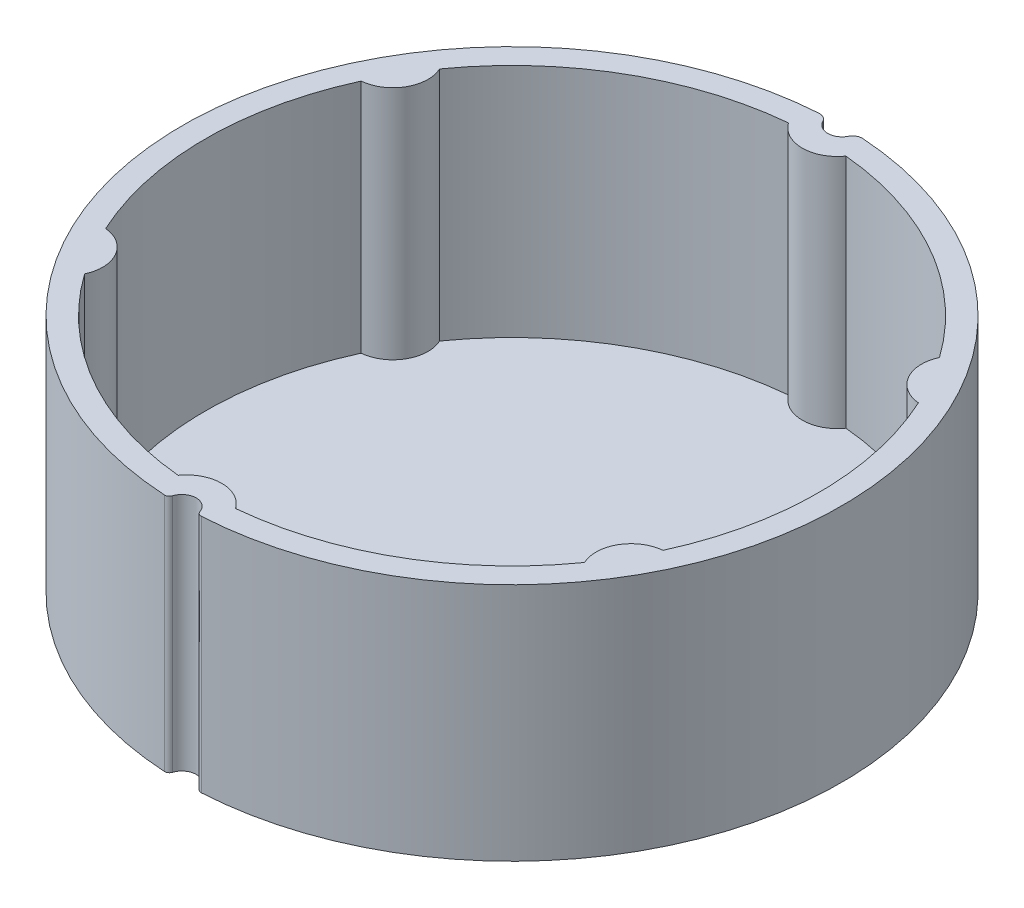
ISO-10303-21;
HEADER;
FILE_DESCRIPTION(('STEP AP214'),'2;1');
FILE_NAME('part.step','',(''),(''),'','','');
FILE_SCHEMA(('AUTOMOTIVE_DESIGN { 1 0 10303 214 1 1 1 1 }'));
ENDSEC;
DATA;
#1=APPLICATION_CONTEXT('core data for automotive mechanical design processes');
#2=APPLICATION_PROTOCOL_DEFINITION('international standard','automotive_design',2000,#1);
#3=PRODUCT_CONTEXT('',#1,'mechanical');
#4=PRODUCT('Part','Part','',(#3));
#5=PRODUCT_RELATED_PRODUCT_CATEGORY('part','',(#4));
#6=PRODUCT_DEFINITION_FORMATION('','',#4);
#7=PRODUCT_DEFINITION_CONTEXT('part definition',#1,'design');
#8=PRODUCT_DEFINITION('design','',#6,#7);
#9=PRODUCT_DEFINITION_SHAPE('','',#8);
#10=(LENGTH_UNIT() NAMED_UNIT(*) SI_UNIT(.MILLI.,.METRE.));
#11=(NAMED_UNIT(*) PLANE_ANGLE_UNIT() SI_UNIT($,.RADIAN.));
#12=(NAMED_UNIT(*) SI_UNIT($,.STERADIAN.) SOLID_ANGLE_UNIT());
#13=UNCERTAINTY_MEASURE_WITH_UNIT(LENGTH_MEASURE(1.E-05),#10,'distance_accuracy_value','');
#14=(GEOMETRIC_REPRESENTATION_CONTEXT(3) GLOBAL_UNCERTAINTY_ASSIGNED_CONTEXT((#13)) GLOBAL_UNIT_ASSIGNED_CONTEXT((#10,
#11,#12)) REPRESENTATION_CONTEXT('',''));
#15=CARTESIAN_POINT('',(0.,0.,0.));
#16=DIRECTION('',(0.,0.,1.));
#17=DIRECTION('',(1.,0.,0.));
#18=AXIS2_PLACEMENT_3D('',#15,#16,#17);
#19=CARTESIAN_POINT('',(0.,-90.5096679918781,0.));
#20=DIRECTION('',(0.,1.,0.));
#21=DIRECTION('',(0.,0.,1.));
#22=AXIS2_PLACEMENT_3D('',#19,#20,#21);
#23=CYLINDRICAL_SURFACE('',#22,32.);
#24=DIRECTION('',(0.,-1.,0.));
#25=VECTOR('',#24,1.);
#26=CARTESIAN_POINT('',(-29.0907593226426,31.177738025806,-13.331456110721));
#27=LINE('',#26,#25);
#28=CARTESIAN_POINT('',(-29.0907593226426,25.,-13.331456110721));
#29=VERTEX_POINT('',#28);
#30=CARTESIAN_POINT('',(-29.0907593226426,0.400000000000001,-13.331456110721));
#31=VERTEX_POINT('',#30);
#32=EDGE_CURVE('E58',#29,#31,#27,.T.);
#33=ORIENTED_EDGE('',*,*,#32,.F.);
#34=CARTESIAN_POINT('',(0.,25.,0.));
#35=DIRECTION('',(0.,1.,0.));
#36=DIRECTION('',(0.,0.,1.));
#37=AXIS2_PLACEMENT_3D('',#34,#35,#36);
#38=CIRCLE('',#37,32.);
#39=CARTESIAN_POINT('',(-29.0907593226429,25.,13.3314561107204));
#40=VERTEX_POINT('',#39);
#41=EDGE_CURVE('E191',#29,#40,#38,.T.);
#42=ORIENTED_EDGE('',*,*,#41,.T.);
#43=DIRECTION('',(0.,-1.,0.));
#44=VECTOR('',#43,1.);
#45=CARTESIAN_POINT('',(-29.0907593226429,31.177738025806,13.3314561107204));
#46=LINE('',#45,#44);
#47=CARTESIAN_POINT('',(-29.0907593226429,0.4,13.3314561107204));
#48=VERTEX_POINT('',#47);
#49=EDGE_CURVE('E185',#40,#48,#46,.T.);
#50=ORIENTED_EDGE('',*,*,#49,.T.);
#51=CARTESIAN_POINT('',(0.,0.399999999999998,0.));
#52=DIRECTION('',(0.,1.,0.));
#53=DIRECTION('',(0.,0.,1.));
#54=AXIS2_PLACEMENT_3D('',#51,#52,#53);
#55=CIRCLE('',#54,32.);
#56=EDGE_CURVE('E194',#48,#31,#55,.F.);
#57=ORIENTED_EDGE('',*,*,#56,.T.);
#58=EDGE_LOOP('',(#33,#42,#50,#57));
#59=FACE_BOUND('',#58,.T.);
#60=ADVANCED_FACE('F43',(#59),#23,.F.);
#61=DIRECTION('',(0.,-1.,0.));
#62=VECTOR('',#61,1.);
#63=CARTESIAN_POINT('',(-26.0907593226426,31.177738025806,-18.5276085334276));
#64=LINE('',#63,#62);
#65=CARTESIAN_POINT('',(-26.0907593226426,25.,-18.5276085334276));
#66=VERTEX_POINT('',#65);
#67=CARTESIAN_POINT('',(-26.0907593226426,0.4,-18.5276085334276));
#68=VERTEX_POINT('',#67);
#69=EDGE_CURVE('E180',#66,#68,#64,.T.);
#70=ORIENTED_EDGE('',*,*,#69,.T.);
#71=CARTESIAN_POINT('',(-2.99999999999998,0.400000000000001,-31.859064644148));
#72=VERTEX_POINT('',#71);
#73=EDGE_CURVE('E204',#68,#72,#55,.F.);
#74=ORIENTED_EDGE('',*,*,#73,.T.);
#75=DIRECTION('',(0.,-1.,0.));
#76=VECTOR('',#75,1.);
#77=CARTESIAN_POINT('',(-3.,31.2361847310675,-31.859064644148));
#78=LINE('',#77,#76);
#79=CARTESIAN_POINT('',(-3.,25.,-31.859064644148));
#80=VERTEX_POINT('',#79);
#81=EDGE_CURVE('E354',#80,#72,#78,.T.);
#82=ORIENTED_EDGE('',*,*,#81,.F.);
#83=EDGE_CURVE('E201',#80,#66,#38,.T.);
#84=ORIENTED_EDGE('',*,*,#83,.T.);
#85=EDGE_LOOP('',(#70,#74,#82,#84));
#86=FACE_BOUND('',#85,.T.);
#87=ADVANCED_FACE('F318',(#86),#23,.F.);
#88=DIRECTION('',(0.,-1.,0.));
#89=VECTOR('',#88,1.);
#90=CARTESIAN_POINT('',(-26.090759322643,31.177738025806,18.5276085334271));
#91=LINE('',#90,#89);
#92=CARTESIAN_POINT('',(-26.090759322643,25.,18.5276085334271));
#93=VERTEX_POINT('',#92);
#94=CARTESIAN_POINT('',(-26.090759322643,0.400000000000001,18.527608533427));
#95=VERTEX_POINT('',#94);
#96=EDGE_CURVE('E66',#93,#95,#91,.T.);
#97=ORIENTED_EDGE('',*,*,#96,.F.);
#98=CARTESIAN_POINT('',(-3.,25.,31.859064644148));
#99=VERTEX_POINT('',#98);
#100=EDGE_CURVE('E202',#93,#99,#38,.T.);
#101=ORIENTED_EDGE('',*,*,#100,.T.);
#102=DIRECTION('',(0.,-1.,0.));
#103=VECTOR('',#102,1.);
#104=CARTESIAN_POINT('',(-3.,31.2361847310675,31.859064644148));
#105=LINE('',#104,#103);
#106=CARTESIAN_POINT('',(-3.,0.4,31.859064644148));
#107=VERTEX_POINT('',#106);
#108=EDGE_CURVE('E391',#99,#107,#105,.T.);
#109=ORIENTED_EDGE('',*,*,#108,.T.);
#110=EDGE_CURVE('E404',#107,#95,#55,.F.);
#111=ORIENTED_EDGE('',*,*,#110,.T.);
#112=EDGE_LOOP('',(#97,#101,#109,#111));
#113=FACE_BOUND('',#112,.T.);
#114=ADVANCED_FACE('F323',(#113),#23,.F.);
#115=DIRECTION('',(0.,-1.,0.));
#116=VECTOR('',#115,1.);
#117=CARTESIAN_POINT('',(3.,31.2361847310675,31.859064644148));
#118=LINE('',#117,#116);
#119=CARTESIAN_POINT('',(3.,25.,31.859064644148));
#120=VERTEX_POINT('',#119);
#121=CARTESIAN_POINT('',(2.99999999999998,0.400000000000001,31.859064644148));
#122=VERTEX_POINT('',#121);
#123=EDGE_CURVE('E387',#120,#122,#118,.T.);
#124=ORIENTED_EDGE('',*,*,#123,.F.);
#125=CARTESIAN_POINT('',(26.0907593226427,25.,18.5276085334274));
#126=VERTEX_POINT('',#125);
#127=EDGE_CURVE('E206',#120,#126,#38,.T.);
#128=ORIENTED_EDGE('',*,*,#127,.T.);
#129=DIRECTION('',(0.,-1.,0.));
#130=VECTOR('',#129,1.);
#131=CARTESIAN_POINT('',(26.0907593226427,31.177738025806,18.5276085334274));
#132=LINE('',#131,#130);
#133=CARTESIAN_POINT('',(26.0907593226427,0.4,18.5276085334274));
#134=VERTEX_POINT('',#133);
#135=EDGE_CURVE('E377',#126,#134,#132,.T.);
#136=ORIENTED_EDGE('',*,*,#135,.T.);
#137=EDGE_CURVE('E405',#134,#122,#55,.F.);
#138=ORIENTED_EDGE('',*,*,#137,.T.);
#139=EDGE_LOOP('',(#124,#128,#136,#138));
#140=FACE_BOUND('',#139,.T.);
#141=ADVANCED_FACE('F333',(#140),#23,.F.);
#142=DIRECTION('',(0.,-1.,0.));
#143=VECTOR('',#142,1.);
#144=CARTESIAN_POINT('',(29.0907593226427,31.177738025806,13.3314561107208));
#145=LINE('',#144,#143);
#146=CARTESIAN_POINT('',(29.0907593226427,25.,13.3314561107208));
#147=VERTEX_POINT('',#146);
#148=CARTESIAN_POINT('',(29.0907593226427,0.400000000000001,13.3314561107208));
#149=VERTEX_POINT('',#148);
#150=EDGE_CURVE('E373',#147,#149,#145,.T.);
#151=ORIENTED_EDGE('',*,*,#150,.F.);
#152=CARTESIAN_POINT('',(29.0907593226428,25.,-13.3314561107206));
#153=VERTEX_POINT('',#152);
#154=EDGE_CURVE('E351',#147,#153,#38,.T.);
#155=ORIENTED_EDGE('',*,*,#154,.T.);
#156=DIRECTION('',(0.,-1.,0.));
#157=VECTOR('',#156,1.);
#158=CARTESIAN_POINT('',(29.0907593226428,31.177738025806,-13.3314561107206));
#159=LINE('',#158,#157);
#160=CARTESIAN_POINT('',(29.0907593226428,0.4,-13.3314561107206));
#161=VERTEX_POINT('',#160);
#162=EDGE_CURVE('E344',#153,#161,#159,.T.);
#163=ORIENTED_EDGE('',*,*,#162,.T.);
#164=EDGE_CURVE('E215',#161,#149,#55,.F.);
#165=ORIENTED_EDGE('',*,*,#164,.T.);
#166=EDGE_LOOP('',(#151,#155,#163,#165));
#167=FACE_BOUND('',#166,.T.);
#168=ADVANCED_FACE('F327',(#167),#23,.F.);
#169=DIRECTION('',(0.,-1.,0.));
#170=VECTOR('',#169,1.);
#171=CARTESIAN_POINT('',(26.0907593226428,31.177738025806,-18.5276085334272));
#172=LINE('',#171,#170);
#173=CARTESIAN_POINT('',(26.0907593226428,25.,-18.5276085334272));
#174=VERTEX_POINT('',#173);
#175=CARTESIAN_POINT('',(26.0907593226428,0.400000000000001,-18.5276085334272));
#176=VERTEX_POINT('',#175);
#177=EDGE_CURVE('E336',#174,#176,#172,.T.);
#178=ORIENTED_EDGE('',*,*,#177,.F.);
#179=CARTESIAN_POINT('',(3.,25.,-31.859064644148));
#180=VERTEX_POINT('',#179);
#181=EDGE_CURVE('E205',#174,#180,#38,.T.);
#182=ORIENTED_EDGE('',*,*,#181,.T.);
#183=DIRECTION('',(0.,-1.,0.));
#184=VECTOR('',#183,1.);
#185=CARTESIAN_POINT('',(3.,31.2361847310675,-31.859064644148));
#186=LINE('',#185,#184);
#187=CARTESIAN_POINT('',(3.,0.4,-31.859064644148));
#188=VERTEX_POINT('',#187);
#189=EDGE_CURVE('E209',#180,#188,#186,.T.);
#190=ORIENTED_EDGE('',*,*,#189,.T.);
#191=EDGE_CURVE('E211',#188,#176,#55,.F.);
#192=ORIENTED_EDGE('',*,*,#191,.T.);
#193=EDGE_LOOP('',(#178,#182,#190,#192));
#194=FACE_BOUND('',#193,.T.);
#195=ADVANCED_FACE('F319',(#194),#23,.F.);
#196=CARTESIAN_POINT('',(-1.91626157924767,25.,33.8457965124164));
#197=DIRECTION('',(0.,-1.,0.));
#198=DIRECTION('',(0.,0.,-1.));
#199=AXIS2_PLACEMENT_3D('',#196,#197,#198);
#200=CYLINDRICAL_SURFACE('',#199,0.499999999999997);
#201=CARTESIAN_POINT('',(-1.91626157924767,0.,33.8457965124164));
#202=DIRECTION('',(0.,1.,0.));
#203=DIRECTION('',(0.,0.,1.));
#204=AXIS2_PLACEMENT_3D('',#201,#202,#203);
#205=CIRCLE('',#204,0.499999999999997);
#206=CARTESIAN_POINT('',(-1.43995370754552,0.,33.9978846820897));
#207=VERTEX_POINT('',#206);
#208=CARTESIAN_POINT('',(-1.94452502436932,0.,34.3449970509476));
#209=VERTEX_POINT('',#208);
#210=EDGE_CURVE('E214',#207,#209,#205,.F.);
#211=ORIENTED_EDGE('',*,*,#210,.F.);
#212=DIRECTION('',(0.,-1.,0.));
#213=VECTOR('',#212,1.);
#214=CARTESIAN_POINT('',(-1.43995370754552,25.,33.9978846820897));
#215=LINE('',#214,#213);
#216=CARTESIAN_POINT('',(-1.43995370754552,25.,33.9978846820897));
#217=VERTEX_POINT('',#216);
#218=EDGE_CURVE('E12',#217,#207,#215,.T.);
#219=ORIENTED_EDGE('',*,*,#218,.F.);
#220=CARTESIAN_POINT('',(-1.91626157924767,25.,33.8457965124164));
#221=DIRECTION('',(0.,1.,0.));
#222=DIRECTION('',(0.,0.,1.));
#223=AXIS2_PLACEMENT_3D('',#220,#221,#222);
#224=CIRCLE('',#223,0.499999999999997);
#225=CARTESIAN_POINT('',(-1.94452502436932,25.,34.3449970509476));
#226=VERTEX_POINT('',#225);
#227=EDGE_CURVE('E216',#217,#226,#224,.F.);
#228=ORIENTED_EDGE('',*,*,#227,.T.);
#229=DIRECTION('',(0.,-1.,0.));
#230=VECTOR('',#229,1.);
#231=CARTESIAN_POINT('',(-1.94452502436932,25.,34.3449970509476));
#232=LINE('',#231,#230);
#233=EDGE_CURVE('E237',#226,#209,#232,.T.);
#234=ORIENTED_EDGE('',*,*,#233,.T.);
#235=EDGE_LOOP('',(#211,#219,#228,#234));
#236=FACE_BOUND('',#235,.T.);
#237=ADVANCED_FACE('F45',(#236),#200,.T.);
#238=CARTESIAN_POINT('',(-0.0110300924390449,25.,34.4541491911095));
#239=DIRECTION('',(0.,-1.,0.));
#240=DIRECTION('',(0.,0.,-1.));
#241=AXIS2_PLACEMENT_3D('',#238,#239,#240);
#242=CYLINDRICAL_SURFACE('',#241,1.50000000000002);
#243=CARTESIAN_POINT('',(-0.0110300924390449,0.,34.4541491911095));
#244=DIRECTION('',(0.,1.,0.));
#245=DIRECTION('',(0.,0.,1.));
#246=AXIS2_PLACEMENT_3D('',#243,#244,#245);
#247=CIRCLE('',#246,1.50000000000002);
#248=CARTESIAN_POINT('',(1.41818536522127,0.,33.9987996818478));
#249=VERTEX_POINT('',#248);
#250=EDGE_CURVE('E240',#249,#207,#247,.T.);
#251=ORIENTED_EDGE('',*,*,#250,.F.);
#252=DIRECTION('',(0.,-1.,0.));
#253=VECTOR('',#252,1.);
#254=CARTESIAN_POINT('',(1.41818536522127,25.,33.9987996818478));
#255=LINE('',#254,#253);
#256=CARTESIAN_POINT('',(1.41818536522127,25.,33.9987996818478));
#257=VERTEX_POINT('',#256);
#258=EDGE_CURVE('E51',#257,#249,#255,.T.);
#259=ORIENTED_EDGE('',*,*,#258,.F.);
#260=CARTESIAN_POINT('',(-0.0110300924390449,25.,34.4541491911095));
#261=DIRECTION('',(0.,1.,0.));
#262=DIRECTION('',(0.,0.,1.));
#263=AXIS2_PLACEMENT_3D('',#260,#261,#262);
#264=CIRCLE('',#263,1.50000000000002);
#265=EDGE_CURVE('E219',#257,#217,#264,.T.);
#266=ORIENTED_EDGE('',*,*,#265,.T.);
#267=ORIENTED_EDGE('',*,*,#218,.T.);
#268=EDGE_LOOP('',(#251,#259,#266,#267));
#269=FACE_BOUND('',#268,.T.);
#270=ADVANCED_FACE('F281',(#269),#242,.F.);
#271=CARTESIAN_POINT('',(1.8945905177747,25.,33.8470165120939));
#272=DIRECTION('',(0.,-1.,0.));
#273=DIRECTION('',(0.,0.,-1.));
#274=AXIS2_PLACEMENT_3D('',#271,#272,#273);
#275=CYLINDRICAL_SURFACE('',#274,0.499999999999999);
#276=CARTESIAN_POINT('',(1.8945905177747,0.,33.8470165120939));
#277=DIRECTION('',(0.,1.,0.));
#278=DIRECTION('',(0.,0.,1.));
#279=AXIS2_PLACEMENT_3D('',#276,#277,#278);
#280=CIRCLE('',#279,0.499999999999999);
#281=CARTESIAN_POINT('',(1.92253433072123,0.,34.3462350447207));
#282=VERTEX_POINT('',#281);
#283=EDGE_CURVE('E243',#249,#282,#280,.T.);
#284=ORIENTED_EDGE('',*,*,#283,.T.);
#285=DIRECTION('',(0.,-1.,0.));
#286=VECTOR('',#285,1.);
#287=CARTESIAN_POINT('',(1.92253433072123,25.,34.3462350447207));
#288=LINE('',#287,#286);
#289=CARTESIAN_POINT('',(1.92253433072123,25.,34.3462350447207));
#290=VERTEX_POINT('',#289);
#291=EDGE_CURVE('E268',#290,#282,#288,.T.);
#292=ORIENTED_EDGE('',*,*,#291,.F.);
#293=CARTESIAN_POINT('',(1.8945905177747,25.,33.8470165120939));
#294=DIRECTION('',(0.,1.,0.));
#295=DIRECTION('',(0.,0.,1.));
#296=AXIS2_PLACEMENT_3D('',#293,#294,#295);
#297=CIRCLE('',#296,0.499999999999999);
#298=EDGE_CURVE('E223',#257,#290,#297,.T.);
#299=ORIENTED_EDGE('',*,*,#298,.F.);
#300=ORIENTED_EDGE('',*,*,#258,.T.);
#301=EDGE_LOOP('',(#284,#292,#299,#300));
#302=FACE_BOUND('',#301,.T.);
#303=ADVANCED_FACE('F273',(#302),#275,.T.);
#304=CARTESIAN_POINT('',(0.,25.,0.));
#305=DIRECTION('',(0.,-1.,0.));
#306=DIRECTION('',(0.,0.,-1.));
#307=AXIS2_PLACEMENT_3D('',#304,#305,#306);
#308=CYLINDRICAL_SURFACE('',#307,34.4);
#309=CARTESIAN_POINT('',(0.,0.,0.));
#310=DIRECTION('',(0.,1.,0.));
#311=DIRECTION('',(0.,0.,1.));
#312=AXIS2_PLACEMENT_3D('',#309,#310,#311);
#313=CIRCLE('',#312,34.4);
#314=CARTESIAN_POINT('',(2.29747762435663,0.,-34.3231932746005));
#315=VERTEX_POINT('',#314);
#316=EDGE_CURVE('E245',#282,#315,#313,.T.);
#317=ORIENTED_EDGE('',*,*,#316,.T.);
#318=DIRECTION('',(0.,-1.,0.));
#319=VECTOR('',#318,1.);
#320=CARTESIAN_POINT('',(2.29747762435663,25.,-34.3231932746005));
#321=LINE('',#320,#319);
#322=CARTESIAN_POINT('',(2.29747762435663,25.,-34.3231932746005));
#323=VERTEX_POINT('',#322);
#324=EDGE_CURVE('E266',#323,#315,#321,.T.);
#325=ORIENTED_EDGE('',*,*,#324,.F.);
#326=CARTESIAN_POINT('',(0.,25.,0.));
#327=DIRECTION('',(0.,1.,0.));
#328=DIRECTION('',(0.,0.,1.));
#329=AXIS2_PLACEMENT_3D('',#326,#327,#328);
#330=CIRCLE('',#329,34.4);
#331=EDGE_CURVE('E225',#290,#323,#330,.T.);
#332=ORIENTED_EDGE('',*,*,#331,.F.);
#333=ORIENTED_EDGE('',*,*,#291,.T.);
#334=EDGE_LOOP('',(#317,#325,#332,#333));
#335=FACE_BOUND('',#334,.T.);
#336=ADVANCED_FACE('F306',(#335),#308,.T.);
#337=CARTESIAN_POINT('',(2.23069048411371,25.,-33.3254260282458));
#338=DIRECTION('',(0.,-1.,0.));
#339=DIRECTION('',(0.,0.,-1.));
#340=AXIS2_PLACEMENT_3D('',#337,#338,#339);
#341=CYLINDRICAL_SURFACE('',#340,1.);
#342=CARTESIAN_POINT('',(2.23069048411371,0.,-33.3254260282458));
#343=DIRECTION('',(0.,1.,0.));
#344=DIRECTION('',(0.,0.,1.));
#345=AXIS2_PLACEMENT_3D('',#342,#343,#344);
#346=CIRCLE('',#345,1.);
#347=CARTESIAN_POINT('',(1.33841429046819,0.,-33.7769159996222));
#348=VERTEX_POINT('',#347);
#349=EDGE_CURVE('E248',#348,#315,#346,.F.);
#350=ORIENTED_EDGE('',*,*,#349,.F.);
#351=DIRECTION('',(0.,-1.,0.));
#352=VECTOR('',#351,1.);
#353=CARTESIAN_POINT('',(1.33841429046819,25.,-33.7769159996222));
#354=LINE('',#353,#352);
#355=CARTESIAN_POINT('',(1.33841429046819,25.,-33.7769159996222));
#356=VERTEX_POINT('',#355);
#357=EDGE_CURVE('E264',#356,#348,#354,.T.);
#358=ORIENTED_EDGE('',*,*,#357,.F.);
#359=CARTESIAN_POINT('',(2.23069048411371,25.,-33.3254260282458));
#360=DIRECTION('',(0.,1.,0.));
#361=DIRECTION('',(0.,0.,1.));
#362=AXIS2_PLACEMENT_3D('',#359,#360,#361);
#363=CIRCLE('',#362,1.);
#364=EDGE_CURVE('E227',#356,#323,#363,.F.);
#365=ORIENTED_EDGE('',*,*,#364,.T.);
#366=ORIENTED_EDGE('',*,*,#324,.T.);
#367=EDGE_LOOP('',(#350,#358,#365,#366));
#368=FACE_BOUND('',#367,.T.);
#369=ADVANCED_FACE('F301',(#368),#341,.T.);
#370=CARTESIAN_POINT('',(0.,25.,-34.4541509566868));
#371=DIRECTION('',(0.,-1.,0.));
#372=DIRECTION('',(0.,0.,-1.));
#373=AXIS2_PLACEMENT_3D('',#370,#371,#372);
#374=CYLINDRICAL_SURFACE('',#373,1.49999999999991);
#375=CARTESIAN_POINT('',(0.,0.,-34.4541509566868));
#376=DIRECTION('',(0.,1.,0.));
#377=DIRECTION('',(0.,0.,1.));
#378=AXIS2_PLACEMENT_3D('',#375,#376,#377);
#379=CIRCLE('',#378,1.49999999999991);
#380=CARTESIAN_POINT('',(-1.33841429046819,0.,-33.7769159996222));
#381=VERTEX_POINT('',#380);
#382=EDGE_CURVE('E251',#381,#348,#379,.T.);
#383=ORIENTED_EDGE('',*,*,#382,.F.);
#384=DIRECTION('',(0.,-1.,0.));
#385=VECTOR('',#384,1.);
#386=CARTESIAN_POINT('',(-1.33841429046819,25.,-33.7769159996222));
#387=LINE('',#386,#385);
#388=CARTESIAN_POINT('',(-1.33841429046819,25.,-33.7769159996222));
#389=VERTEX_POINT('',#388);
#390=EDGE_CURVE('E262',#389,#381,#387,.T.);
#391=ORIENTED_EDGE('',*,*,#390,.F.);
#392=CARTESIAN_POINT('',(0.,25.,-34.4541509566868));
#393=DIRECTION('',(0.,1.,0.));
#394=DIRECTION('',(0.,0.,1.));
#395=AXIS2_PLACEMENT_3D('',#392,#393,#394);
#396=CIRCLE('',#395,1.49999999999991);
#397=EDGE_CURVE('E230',#389,#356,#396,.T.);
#398=ORIENTED_EDGE('',*,*,#397,.T.);
#399=ORIENTED_EDGE('',*,*,#357,.T.);
#400=EDGE_LOOP('',(#383,#391,#398,#399));
#401=FACE_BOUND('',#400,.T.);
#402=ADVANCED_FACE('F298',(#401),#374,.F.);
#403=CARTESIAN_POINT('',(-2.23069048411371,25.,-33.3254260282458));
#404=DIRECTION('',(0.,-1.,0.));
#405=DIRECTION('',(0.,0.,-1.));
#406=AXIS2_PLACEMENT_3D('',#403,#404,#405);
#407=CYLINDRICAL_SURFACE('',#406,1.);
#408=CARTESIAN_POINT('',(-2.23069048411371,0.,-33.3254260282458));
#409=DIRECTION('',(0.,1.,0.));
#410=DIRECTION('',(0.,0.,1.));
#411=AXIS2_PLACEMENT_3D('',#408,#409,#410);
#412=CIRCLE('',#411,1.);
#413=CARTESIAN_POINT('',(-2.29747762435663,0.,-34.3231932746005));
#414=VERTEX_POINT('',#413);
#415=EDGE_CURVE('E254',#381,#414,#412,.T.);
#416=ORIENTED_EDGE('',*,*,#415,.T.);
#417=DIRECTION('',(0.,-1.,0.));
#418=VECTOR('',#417,1.);
#419=CARTESIAN_POINT('',(-2.29747762435663,25.,-34.3231932746005));
#420=LINE('',#419,#418);
#421=CARTESIAN_POINT('',(-2.29747762435663,25.,-34.3231932746005));
#422=VERTEX_POINT('',#421);
#423=EDGE_CURVE('E259',#422,#414,#420,.T.);
#424=ORIENTED_EDGE('',*,*,#423,.F.);
#425=CARTESIAN_POINT('',(-2.23069048411371,25.,-33.3254260282458));
#426=DIRECTION('',(0.,1.,0.));
#427=DIRECTION('',(0.,0.,1.));
#428=AXIS2_PLACEMENT_3D('',#425,#426,#427);
#429=CIRCLE('',#428,1.);
#430=EDGE_CURVE('E233',#389,#422,#429,.T.);
#431=ORIENTED_EDGE('',*,*,#430,.F.);
#432=ORIENTED_EDGE('',*,*,#390,.T.);
#433=EDGE_LOOP('',(#416,#424,#431,#432));
#434=FACE_BOUND('',#433,.T.);
#435=ADVANCED_FACE('F295',(#434),#407,.T.);
#436=CARTESIAN_POINT('',(0.,25.,0.));
#437=DIRECTION('',(0.,-1.,0.));
#438=DIRECTION('',(0.,0.,-1.));
#439=AXIS2_PLACEMENT_3D('',#436,#437,#438);
#440=CYLINDRICAL_SURFACE('',#439,34.4);
#441=CARTESIAN_POINT('',(0.,0.,0.));
#442=DIRECTION('',(0.,1.,0.));
#443=DIRECTION('',(0.,0.,1.));
#444=AXIS2_PLACEMENT_3D('',#441,#442,#443);
#445=CIRCLE('',#444,34.4);
#446=EDGE_CURVE('E220',#414,#209,#445,.T.);
#447=ORIENTED_EDGE('',*,*,#446,.T.);
#448=ORIENTED_EDGE('',*,*,#233,.F.);
#449=CARTESIAN_POINT('',(0.,25.,0.));
#450=DIRECTION('',(0.,1.,0.));
#451=DIRECTION('',(0.,0.,1.));
#452=AXIS2_PLACEMENT_3D('',#449,#450,#451);
#453=CIRCLE('',#452,34.4);
#454=EDGE_CURVE('E235',#422,#226,#453,.T.);
#455=ORIENTED_EDGE('',*,*,#454,.F.);
#456=ORIENTED_EDGE('',*,*,#423,.T.);
#457=EDGE_LOOP('',(#447,#448,#455,#456));
#458=FACE_BOUND('',#457,.T.);
#459=ADVANCED_FACE('F290',(#458),#440,.T.);
#460=CARTESIAN_POINT('',(0.,25.,0.));
#461=DIRECTION('',(0.,1.,0.));
#462=DIRECTION('',(0.,0.,1.));
#463=AXIS2_PLACEMENT_3D('',#460,#461,#462);
#464=PLANE('',#463);
#465=ORIENTED_EDGE('',*,*,#83,.F.);
#466=CARTESIAN_POINT('',(0.,25.,-33.965878322473));
#467=DIRECTION('',(0.,1.,0.));
#468=DIRECTION('',(0.,0.,1.));
#469=AXIS2_PLACEMENT_3D('',#466,#467,#468);
#470=CIRCLE('',#469,3.66587832247298);
#471=EDGE_CURVE('E350',#80,#180,#470,.T.);
#472=ORIENTED_EDGE('',*,*,#471,.T.);
#473=ORIENTED_EDGE('',*,*,#181,.F.);
#474=CARTESIAN_POINT('',(29.4153134891128,25.,-16.9829391612364));
#475=DIRECTION('',(0.,1.,0.));
#476=DIRECTION('',(0.,0.,1.));
#477=AXIS2_PLACEMENT_3D('',#474,#475,#476);
#478=CIRCLE('',#477,3.66587832247298);
#479=EDGE_CURVE('E349',#174,#153,#478,.T.);
#480=ORIENTED_EDGE('',*,*,#479,.T.);
#481=ORIENTED_EDGE('',*,*,#154,.F.);
#482=CARTESIAN_POINT('',(29.4153134891127,25.,16.9829391612366));
#483=DIRECTION('',(0.,1.,0.));
#484=DIRECTION('',(0.,0.,1.));
#485=AXIS2_PLACEMENT_3D('',#482,#483,#484);
#486=CIRCLE('',#485,3.66587832247298);
#487=EDGE_CURVE('E365',#147,#126,#486,.T.);
#488=ORIENTED_EDGE('',*,*,#487,.T.);
#489=ORIENTED_EDGE('',*,*,#127,.F.);
#490=CARTESIAN_POINT('',(0.,25.,33.965878322473));
#491=DIRECTION('',(0.,1.,0.));
#492=DIRECTION('',(0.,0.,1.));
#493=AXIS2_PLACEMENT_3D('',#490,#491,#492);
#494=CIRCLE('',#493,3.66587832247298);
#495=EDGE_CURVE('E379',#120,#99,#494,.T.);
#496=ORIENTED_EDGE('',*,*,#495,.T.);
#497=ORIENTED_EDGE('',*,*,#100,.F.);
#498=CARTESIAN_POINT('',(-29.4153134891129,25.,16.9829391612362));
#499=DIRECTION('',(0.,1.,0.));
#500=DIRECTION('',(0.,0.,1.));
#501=AXIS2_PLACEMENT_3D('',#498,#499,#500);
#502=CIRCLE('',#501,3.66587832247298);
#503=EDGE_CURVE('E200',#93,#40,#502,.T.);
#504=ORIENTED_EDGE('',*,*,#503,.T.);
#505=ORIENTED_EDGE('',*,*,#41,.F.);
#506=CARTESIAN_POINT('',(-29.4153134891126,25.,-16.9829391612368));
#507=DIRECTION('',(0.,1.,0.));
#508=DIRECTION('',(0.,0.,1.));
#509=AXIS2_PLACEMENT_3D('',#506,#507,#508);
#510=CIRCLE('',#509,3.66587832247298);
#511=EDGE_CURVE('E177',#29,#66,#510,.T.);
#512=ORIENTED_EDGE('',*,*,#511,.T.);
#513=EDGE_LOOP('',(#465,#472,#473,#480,#481,#488,#489,#496,#497,#504,#505,#512));
#514=FACE_BOUND('',#513,.T.);
#515=ORIENTED_EDGE('',*,*,#227,.F.);
#516=ORIENTED_EDGE('',*,*,#265,.F.);
#517=ORIENTED_EDGE('',*,*,#298,.T.);
#518=ORIENTED_EDGE('',*,*,#331,.T.);
#519=ORIENTED_EDGE('',*,*,#364,.F.);
#520=ORIENTED_EDGE('',*,*,#397,.F.);
#521=ORIENTED_EDGE('',*,*,#430,.T.);
#522=ORIENTED_EDGE('',*,*,#454,.T.);
#523=EDGE_LOOP('',(#515,#516,#517,#518,#519,#520,#521,#522));
#524=FACE_BOUND('',#523,.T.);
#525=ADVANCED_FACE('F197',(#514,#524),#464,.T.);
#526=CARTESIAN_POINT('',(0.,0.,0.));
#527=DIRECTION('',(0.,1.,0.));
#528=DIRECTION('',(0.,0.,1.));
#529=AXIS2_PLACEMENT_3D('',#526,#527,#528);
#530=PLANE('',#529);
#531=ORIENTED_EDGE('',*,*,#210,.T.);
#532=ORIENTED_EDGE('',*,*,#446,.F.);
#533=ORIENTED_EDGE('',*,*,#415,.F.);
#534=ORIENTED_EDGE('',*,*,#382,.T.);
#535=ORIENTED_EDGE('',*,*,#349,.T.);
#536=ORIENTED_EDGE('',*,*,#316,.F.);
#537=ORIENTED_EDGE('',*,*,#283,.F.);
#538=ORIENTED_EDGE('',*,*,#250,.T.);
#539=EDGE_LOOP('',(#531,#532,#533,#534,#535,#536,#537,#538));
#540=FACE_BOUND('',#539,.T.);
#541=ADVANCED_FACE('F280',(#540),#530,.F.);
#542=CARTESIAN_POINT('',(0.,0.4,0.));
#543=DIRECTION('',(0.,1.,0.));
#544=DIRECTION('',(0.,0.,1.));
#545=AXIS2_PLACEMENT_3D('',#542,#543,#544);
#546=PLANE('',#545);
#547=ORIENTED_EDGE('',*,*,#73,.F.);
#548=CARTESIAN_POINT('',(-29.4153134891126,0.4,-16.9829391612368));
#549=DIRECTION('',(0.,1.,0.));
#550=DIRECTION('',(-0.866025403784433,0.,-0.50000000000001));
#551=AXIS2_PLACEMENT_3D('',#548,#549,#550);
#552=CIRCLE('',#551,3.66587832247298);
#553=EDGE_CURVE('E186',#31,#68,#552,.T.);
#554=ORIENTED_EDGE('',*,*,#553,.F.);
#555=ORIENTED_EDGE('',*,*,#56,.F.);
#556=CARTESIAN_POINT('',(-29.4153134891129,0.4,16.9829391612362));
#557=DIRECTION('',(0.,1.,0.));
#558=DIRECTION('',(-0.866025403784443,0.,0.499999999999992));
#559=AXIS2_PLACEMENT_3D('',#556,#557,#558);
#560=CIRCLE('',#559,3.66587832247298);
#561=EDGE_CURVE('E397',#95,#48,#560,.T.);
#562=ORIENTED_EDGE('',*,*,#561,.F.);
#563=ORIENTED_EDGE('',*,*,#110,.F.);
#564=CARTESIAN_POINT('',(0.,0.4,33.965878322473));
#565=DIRECTION('',(0.,1.,0.));
#566=DIRECTION('',(0.,0.,1.));
#567=AXIS2_PLACEMENT_3D('',#564,#565,#566);
#568=CIRCLE('',#567,3.66587832247298);
#569=EDGE_CURVE('E385',#122,#107,#568,.T.);
#570=ORIENTED_EDGE('',*,*,#569,.F.);
#571=ORIENTED_EDGE('',*,*,#137,.F.);
#572=CARTESIAN_POINT('',(29.4153134891127,0.4,16.9829391612366));
#573=DIRECTION('',(0.,1.,0.));
#574=DIRECTION('',(0.866025403784436,0.,0.500000000000004));
#575=AXIS2_PLACEMENT_3D('',#572,#573,#574);
#576=CIRCLE('',#575,3.66587832247298);
#577=EDGE_CURVE('E370',#149,#134,#576,.T.);
#578=ORIENTED_EDGE('',*,*,#577,.F.);
#579=ORIENTED_EDGE('',*,*,#164,.F.);
#580=CARTESIAN_POINT('',(29.4153134891128,0.4,-16.9829391612364));
#581=DIRECTION('',(0.,1.,0.));
#582=DIRECTION('',(0.86602540378444,0.,-0.499999999999998));
#583=AXIS2_PLACEMENT_3D('',#580,#581,#582);
#584=CIRCLE('',#583,3.66587832247298);
#585=EDGE_CURVE('E343',#176,#161,#584,.T.);
#586=ORIENTED_EDGE('',*,*,#585,.F.);
#587=ORIENTED_EDGE('',*,*,#191,.F.);
#588=CARTESIAN_POINT('',(0.,0.4,-33.965878322473));
#589=DIRECTION('',(0.,1.,0.));
#590=DIRECTION('',(0.,0.,-1.));
#591=AXIS2_PLACEMENT_3D('',#588,#589,#590);
#592=CIRCLE('',#591,3.66587832247298);
#593=EDGE_CURVE('E352',#72,#188,#592,.T.);
#594=ORIENTED_EDGE('',*,*,#593,.F.);
#595=EDGE_LOOP('',(#547,#554,#555,#562,#563,#570,#571,#578,#579,#586,#587,#594));
#596=FACE_BOUND('',#595,.T.);
#597=ADVANCED_FACE('F313',(#596),#546,.T.);
#598=CARTESIAN_POINT('',(0.,31.2361847310675,-33.965878322473));
#599=DIRECTION('',(0.,-1.,0.));
#600=DIRECTION('',(0.,0.,-1.));
#601=AXIS2_PLACEMENT_3D('',#598,#599,#600);
#602=CYLINDRICAL_SURFACE('',#601,3.66587832247298);
#603=ORIENTED_EDGE('',*,*,#471,.F.);
#604=ORIENTED_EDGE('',*,*,#81,.T.);
#605=ORIENTED_EDGE('',*,*,#593,.T.);
#606=ORIENTED_EDGE('',*,*,#189,.F.);
#607=EDGE_LOOP('',(#603,#604,#605,#606));
#608=FACE_BOUND('',#607,.T.);
#609=ADVANCED_FACE('F406',(#608),#602,.T.);
#610=CARTESIAN_POINT('',(29.4153134891128,31.177738025806,-16.9829391612364));
#611=DIRECTION('',(0.,-1.,0.));
#612=DIRECTION('',(0.,0.,-1.));
#613=AXIS2_PLACEMENT_3D('',#610,#611,#612);
#614=CYLINDRICAL_SURFACE('',#613,3.66587832247298);
#615=ORIENTED_EDGE('',*,*,#479,.F.);
#616=ORIENTED_EDGE('',*,*,#177,.T.);
#617=ORIENTED_EDGE('',*,*,#585,.T.);
#618=ORIENTED_EDGE('',*,*,#162,.F.);
#619=EDGE_LOOP('',(#615,#616,#617,#618));
#620=FACE_BOUND('',#619,.T.);
#621=ADVANCED_FACE('F408',(#620),#614,.T.);
#622=CARTESIAN_POINT('',(29.4153134891127,31.177738025806,16.9829391612366));
#623=DIRECTION('',(0.,-1.,0.));
#624=DIRECTION('',(0.,0.,-1.));
#625=AXIS2_PLACEMENT_3D('',#622,#623,#624);
#626=CYLINDRICAL_SURFACE('',#625,3.66587832247298);
#627=ORIENTED_EDGE('',*,*,#487,.F.);
#628=ORIENTED_EDGE('',*,*,#150,.T.);
#629=ORIENTED_EDGE('',*,*,#577,.T.);
#630=ORIENTED_EDGE('',*,*,#135,.F.);
#631=EDGE_LOOP('',(#627,#628,#629,#630));
#632=FACE_BOUND('',#631,.T.);
#633=ADVANCED_FACE('F414',(#632),#626,.T.);
#634=CARTESIAN_POINT('',(0.,31.2361847310675,33.965878322473));
#635=DIRECTION('',(0.,-1.,0.));
#636=DIRECTION('',(0.,0.,-1.));
#637=AXIS2_PLACEMENT_3D('',#634,#635,#636);
#638=CYLINDRICAL_SURFACE('',#637,3.66587832247298);
#639=ORIENTED_EDGE('',*,*,#495,.F.);
#640=ORIENTED_EDGE('',*,*,#123,.T.);
#641=ORIENTED_EDGE('',*,*,#569,.T.);
#642=ORIENTED_EDGE('',*,*,#108,.F.);
#643=EDGE_LOOP('',(#639,#640,#641,#642));
#644=FACE_BOUND('',#643,.T.);
#645=ADVANCED_FACE('F419',(#644),#638,.T.);
#646=CARTESIAN_POINT('',(-29.4153134891129,31.177738025806,16.9829391612362));
#647=DIRECTION('',(0.,-1.,0.));
#648=DIRECTION('',(0.,0.,-1.));
#649=AXIS2_PLACEMENT_3D('',#646,#647,#648);
#650=CYLINDRICAL_SURFACE('',#649,3.66587832247298);
#651=ORIENTED_EDGE('',*,*,#503,.F.);
#652=ORIENTED_EDGE('',*,*,#96,.T.);
#653=ORIENTED_EDGE('',*,*,#561,.T.);
#654=ORIENTED_EDGE('',*,*,#49,.F.);
#655=EDGE_LOOP('',(#651,#652,#653,#654));
#656=FACE_BOUND('',#655,.T.);
#657=ADVANCED_FACE('F423',(#656),#650,.T.);
#658=CARTESIAN_POINT('',(-29.4153134891126,31.177738025806,-16.9829391612368));
#659=DIRECTION('',(0.,-1.,0.));
#660=DIRECTION('',(0.,0.,-1.));
#661=AXIS2_PLACEMENT_3D('',#658,#659,#660);
#662=CYLINDRICAL_SURFACE('',#661,3.66587832247298);
#663=ORIENTED_EDGE('',*,*,#511,.F.);
#664=ORIENTED_EDGE('',*,*,#32,.T.);
#665=ORIENTED_EDGE('',*,*,#553,.T.);
#666=ORIENTED_EDGE('',*,*,#69,.F.);
#667=EDGE_LOOP('',(#663,#664,#665,#666));
#668=FACE_BOUND('',#667,.T.);
#669=ADVANCED_FACE('F178',(#668),#662,.T.);
#670=CLOSED_SHELL('',(#60,#87,#114,#141,#168,#195,#237,#270,#303,#336,#369,#402,#435,#459,#525,
#541,#597,#609,#621,#633,#645,#657,#669));
#671=MANIFOLD_SOLID_BREP('B2',#670);
#672=ADVANCED_BREP_SHAPE_REPRESENTATION('',(#18,#671),#14);
#673=SHAPE_DEFINITION_REPRESENTATION(#9,#672);
ENDSEC;
END-ISO-10303-21;
